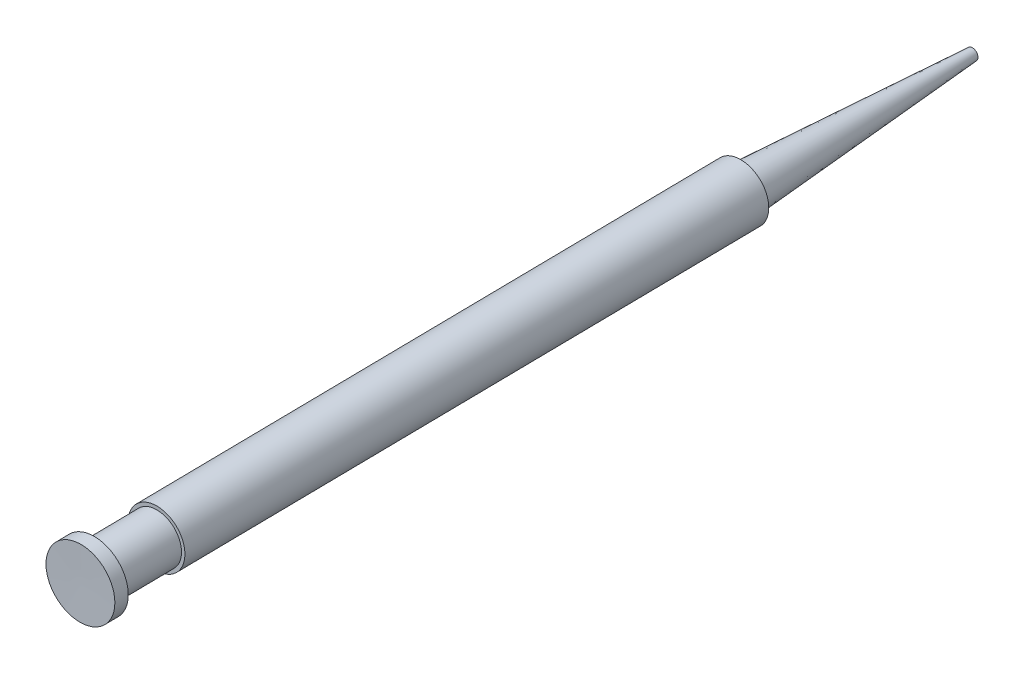
ISO-10303-21;
HEADER;
FILE_DESCRIPTION(('STEP AP214'),'2;1');
FILE_NAME('part.step','',(''),(''),'','','');
FILE_SCHEMA(('AUTOMOTIVE_DESIGN { 1 0 10303 214 1 1 1 1 }'));
ENDSEC;
DATA;
#1=APPLICATION_CONTEXT('core data for automotive mechanical design processes');
#2=APPLICATION_PROTOCOL_DEFINITION('international standard','automotive_design',2000,#1);
#3=PRODUCT_CONTEXT('',#1,'mechanical');
#4=PRODUCT('Part','Part','',(#3));
#5=PRODUCT_RELATED_PRODUCT_CATEGORY('part','',(#4));
#6=PRODUCT_DEFINITION_FORMATION('','',#4);
#7=PRODUCT_DEFINITION_CONTEXT('part definition',#1,'design');
#8=PRODUCT_DEFINITION('design','',#6,#7);
#9=PRODUCT_DEFINITION_SHAPE('','',#8);
#10=(LENGTH_UNIT() NAMED_UNIT(*) SI_UNIT(.MILLI.,.METRE.));
#11=(NAMED_UNIT(*) PLANE_ANGLE_UNIT() SI_UNIT($,.RADIAN.));
#12=(NAMED_UNIT(*) SI_UNIT($,.STERADIAN.) SOLID_ANGLE_UNIT());
#13=UNCERTAINTY_MEASURE_WITH_UNIT(LENGTH_MEASURE(1.E-05),#10,'distance_accuracy_value','');
#14=(GEOMETRIC_REPRESENTATION_CONTEXT(3) GLOBAL_UNCERTAINTY_ASSIGNED_CONTEXT((#13)) GLOBAL_UNIT_ASSIGNED_CONTEXT((#10,
#11,#12)) REPRESENTATION_CONTEXT('',''));
#15=CARTESIAN_POINT('',(0.,0.,0.));
#16=DIRECTION('',(0.,0.,1.));
#17=DIRECTION('',(1.,0.,0.));
#18=AXIS2_PLACEMENT_3D('',#15,#16,#17);
#19=CARTESIAN_POINT('',(24.518689414547,0.,-43.7700324668464));
#20=DIRECTION('',(0.0136017753518528,0.,0.999907491574735));
#21=DIRECTION('',(0.999907491574735,0.,-0.0136017753518528));
#22=AXIS2_PLACEMENT_3D('',#19,#20,#21);
#23=CONICAL_SURFACE('',#22,0.615781776394914,1.55719413200124);
#24=CARTESIAN_POINT('',(24.5185754792719,0.,-43.7784081922347));
#25=VERTEX_POINT('',#24);
#26=VERTEX_LOOP('',#25);
#27=FACE_BOUND('',#26,.T.);
#28=CARTESIAN_POINT('',(24.518689414547,0.,-43.7700324668464));
#29=DIRECTION('',(-0.0136017753518528,0.,-0.999907491574735));
#30=DIRECTION('',(-0.999907491574735,0.,0.0136017753518528));
#31=AXIS2_PLACEMENT_3D('',#28,#29,#30);
#32=CIRCLE('',#31,0.615781776394913);
#33=CARTESIAN_POINT('',(23.9029646031545,0.,-43.7616567414581));
#34=VERTEX_POINT('',#33);
#35=EDGE_CURVE('E11',#34,#34,#32,.T.);
#36=ORIENTED_EDGE('',*,*,#35,.T.);
#37=EDGE_LOOP('',(#36));
#38=FACE_BOUND('',#37,.T.);
#39=ADVANCED_FACE('F32',(#27,#38),#23,.T.);
#40=CARTESIAN_POINT('',(24.8717378510663,0.,-17.8163780774306));
#41=DIRECTION('',(0.0136017753518528,0.,0.999907491574735));
#42=DIRECTION('',(0.999907491574735,0.,-0.0136017753518528));
#43=AXIS2_PLACEMENT_3D('',#40,#41,#42);
#44=CONICAL_SURFACE('',#43,2.29208480946518,0.0644927844459086);
#45=ORIENTED_EDGE('',*,*,#35,.F.);
#46=EDGE_LOOP('',(#45));
#47=FACE_BOUND('',#46,.T.);
#48=CARTESIAN_POINT('',(24.8717378510663,0.,-17.8163780774306));
#49=DIRECTION('',(-0.0136017753518528,0.,-0.999907491574735));
#50=DIRECTION('',(-0.999907491574735,0.,0.0136017753518528));
#51=AXIS2_PLACEMENT_3D('',#48,#49,#50);
#52=CIRCLE('',#51,2.29208480946518);
#53=CARTESIAN_POINT('',(22.5798650787575,0.,-17.7852016547649));
#54=VERTEX_POINT('',#53);
#55=EDGE_CURVE('E39',#54,#54,#52,.T.);
#56=ORIENTED_EDGE('',*,*,#55,.T.);
#57=EDGE_LOOP('',(#56));
#58=FACE_BOUND('',#57,.T.);
#59=ADVANCED_FACE('F58',(#47,#58),#44,.T.);
#60=CARTESIAN_POINT('',(24.871887335905,0.,-17.8053889965056));
#61=DIRECTION('',(0.0136017753518528,0.,0.999907491574735));
#62=DIRECTION('',(0.999907491574735,0.,-0.0136017753518528));
#63=AXIS2_PLACEMENT_3D('',#60,#61,#62);
#64=CONICAL_SURFACE('',#63,3.1,1.55719413200125);
#65=ORIENTED_EDGE('',*,*,#55,.F.);
#66=EDGE_LOOP('',(#65));
#67=FACE_BOUND('',#66,.T.);
#68=CARTESIAN_POINT('',(24.871887335905,0.,-17.8053889965056));
#69=DIRECTION('',(-0.0136017753518528,0.,-0.999907491574735));
#70=DIRECTION('',(-0.999907491574735,0.,0.0136017753518528));
#71=AXIS2_PLACEMENT_3D('',#68,#69,#70);
#72=CIRCLE('',#71,3.1);
#73=CARTESIAN_POINT('',(21.7721741120233,0.,-17.7632234929149));
#74=VERTEX_POINT('',#73);
#75=EDGE_CURVE('E70',#74,#74,#72,.T.);
#76=ORIENTED_EDGE('',*,*,#75,.T.);
#77=EDGE_LOOP('',(#76));
#78=FACE_BOUND('',#77,.T.);
#79=ADVANCED_FACE('F62',(#67,#78),#64,.T.);
#80=CARTESIAN_POINT('',(24.8827654025066,0.,-17.0057095423573));
#81=DIRECTION('',(-0.0136017753518528,0.,-0.999907491574735));
#82=DIRECTION('',(-0.999907491574735,0.,0.0136017753518528));
#83=AXIS2_PLACEMENT_3D('',#80,#81,#82);
#84=CYLINDRICAL_SURFACE('',#83,3.1);
#85=ORIENTED_EDGE('',*,*,#75,.F.);
#86=EDGE_LOOP('',(#85));
#87=FACE_BOUND('',#86,.T.);
#88=CARTESIAN_POINT('',(25.7606534914694,0.,47.5304891678038));
#89=DIRECTION('',(-0.0136017753518528,0.,-0.999907491574735));
#90=DIRECTION('',(-0.999907491574735,0.,0.0136017753518528));
#91=AXIS2_PLACEMENT_3D('',#88,#89,#90);
#92=CIRCLE('',#91,3.1);
#93=CARTESIAN_POINT('',(22.6609402675878,0.,47.5726546713946));
#94=VERTEX_POINT('',#93);
#95=EDGE_CURVE('E72',#94,#94,#92,.T.);
#96=ORIENTED_EDGE('',*,*,#95,.T.);
#97=EDGE_LOOP('',(#96));
#98=FACE_BOUND('',#97,.T.);
#99=ADVANCED_FACE('F105',(#87,#98),#84,.T.);
#100=CARTESIAN_POINT('',(25.760584106941,0.,47.5253885020469));
#101=DIRECTION('',(0.0136017753518528,0.,0.999907491574735));
#102=DIRECTION('',(0.999907491574735,0.,-0.0136017753518528));
#103=AXIS2_PLACEMENT_3D('',#100,#101,#102);
#104=CONICAL_SURFACE('',#103,2.725,1.55719413200125);
#105=ORIENTED_EDGE('',*,*,#95,.F.);
#106=EDGE_LOOP('',(#105));
#107=FACE_BOUND('',#106,.T.);
#108=CARTESIAN_POINT('',(25.760584106941,0.,47.5253885020469));
#109=DIRECTION('',(-0.0136017753518528,0.,-0.999907491574735));
#110=DIRECTION('',(-0.999907491574735,0.,0.0136017753518528));
#111=AXIS2_PLACEMENT_3D('',#108,#109,#110);
#112=CIRCLE('',#111,2.725);
#113=CARTESIAN_POINT('',(23.0358361923999,0.,47.5624533398807));
#114=VERTEX_POINT('',#113);
#115=EDGE_CURVE('E77',#114,#114,#112,.T.);
#116=ORIENTED_EDGE('',*,*,#115,.T.);
#117=EDGE_LOOP('',(#116));
#118=FACE_BOUND('',#117,.T.);
#119=ADVANCED_FACE('F98',(#107,#118),#104,.F.);
#120=CARTESIAN_POINT('',(24.8827654025066,0.,-17.0057095423573));
#121=DIRECTION('',(-0.0136017753518528,0.,-0.999907491574735));
#122=DIRECTION('',(-0.999907491574735,0.,0.0136017753518528));
#123=AXIS2_PLACEMENT_3D('',#120,#121,#122);
#124=CYLINDRICAL_SURFACE('',#123,2.725);
#125=ORIENTED_EDGE('',*,*,#115,.F.);
#126=EDGE_LOOP('',(#125));
#127=FACE_BOUND('',#126,.T.);
#128=CARTESIAN_POINT('',(25.855796534404,0.,54.52474094307));
#129=DIRECTION('',(-0.0136017753518528,0.,-0.999907491574735));
#130=DIRECTION('',(-0.999907491574735,0.,0.0136017753518528));
#131=AXIS2_PLACEMENT_3D('',#128,#129,#130);
#132=CIRCLE('',#131,2.725);
#133=CARTESIAN_POINT('',(23.1310486198628,0.,54.5618057809038));
#134=VERTEX_POINT('',#133);
#135=EDGE_CURVE('E80',#134,#134,#132,.T.);
#136=ORIENTED_EDGE('',*,*,#135,.T.);
#137=EDGE_LOOP('',(#136));
#138=FACE_BOUND('',#137,.T.);
#139=ADVANCED_FACE('F92',(#127,#138),#124,.T.);
#140=CARTESIAN_POINT('',(25.8559861854484,0.,54.5386827628057));
#141=DIRECTION('',(0.0136017753518528,0.,0.999907491574735));
#142=DIRECTION('',(0.999907491574735,0.,-0.0136017753518528));
#143=AXIS2_PLACEMENT_3D('',#140,#141,#142);
#144=CONICAL_SURFACE('',#143,3.75,1.55719413200124);
#145=ORIENTED_EDGE('',*,*,#135,.F.);
#146=EDGE_LOOP('',(#145));
#147=FACE_BOUND('',#146,.T.);
#148=CARTESIAN_POINT('',(25.8559861854484,0.,54.5386827628057));
#149=DIRECTION('',(-0.0136017753518528,0.,-0.999907491574735));
#150=DIRECTION('',(-0.999907491574735,0.,0.0136017753518528));
#151=AXIS2_PLACEMENT_3D('',#148,#149,#150);
#152=CIRCLE('',#151,3.75);
#153=CARTESIAN_POINT('',(22.1063330920431,0.,54.5896894203751));
#154=VERTEX_POINT('',#153);
#155=EDGE_CURVE('E83',#154,#154,#152,.T.);
#156=ORIENTED_EDGE('',*,*,#155,.T.);
#157=EDGE_LOOP('',(#156));
#158=FACE_BOUND('',#157,.T.);
#159=ADVANCED_FACE('F53',(#147,#158),#144,.T.);
#160=CARTESIAN_POINT('',(24.8827654025066,0.,-17.0057095423573));
#161=DIRECTION('',(-0.0136017753518528,0.,-0.999907491574735));
#162=DIRECTION('',(-0.999907491574735,0.,0.0136017753518528));
#163=AXIS2_PLACEMENT_3D('',#160,#161,#162);
#164=CYLINDRICAL_SURFACE('',#163,3.75);
#165=ORIENTED_EDGE('',*,*,#155,.F.);
#166=EDGE_LOOP('',(#165));
#167=FACE_BOUND('',#166,.T.);
#168=CARTESIAN_POINT('',(25.8763888484761,0.,56.0385440001678));
#169=DIRECTION('',(-0.0136017753518528,0.,-0.999907491574735));
#170=DIRECTION('',(-0.999907491574735,0.,0.0136017753518528));
#171=AXIS2_PLACEMENT_3D('',#168,#169,#170);
#172=CIRCLE('',#171,3.75);
#173=CARTESIAN_POINT('',(22.1267357550709,0.,56.0895506577372));
#174=VERTEX_POINT('',#173);
#175=EDGE_CURVE('E86',#174,#174,#172,.T.);
#176=ORIENTED_EDGE('',*,*,#175,.T.);
#177=EDGE_LOOP('',(#176));
#178=FACE_BOUND('',#177,.T.);
#179=ADVANCED_FACE('F47',(#167,#178),#164,.T.);
#180=CARTESIAN_POINT('',(25.8756950031919,0.,55.9875373425983));
#181=DIRECTION('',(0.0136017753518528,0.,0.999907491574735));
#182=DIRECTION('',(0.999907491574735,0.,-0.0136017753518528));
#183=AXIS2_PLACEMENT_3D('',#180,#181,#182);
#184=CONICAL_SURFACE('',#183,0.,1.55719413200125);
#185=ORIENTED_EDGE('',*,*,#175,.F.);
#186=EDGE_LOOP('',(#185));
#187=FACE_BOUND('',#186,.T.);
#188=CARTESIAN_POINT('',(25.8756950031919,0.,55.9875373425983));
#189=VERTEX_POINT('',#188);
#190=VERTEX_LOOP('',#189);
#191=FACE_BOUND('',#190,.T.);
#192=ADVANCED_FACE('F45',(#187,#191),#184,.F.);
#193=CLOSED_SHELL('',(#39,#59,#79,#99,#119,#139,#159,#179,#192));
#194=MANIFOLD_SOLID_BREP('B2',#193);
#195=ADVANCED_BREP_SHAPE_REPRESENTATION('',(#18,#194),#14);
#196=SHAPE_DEFINITION_REPRESENTATION(#9,#195);
ENDSEC;
END-ISO-10303-21;
